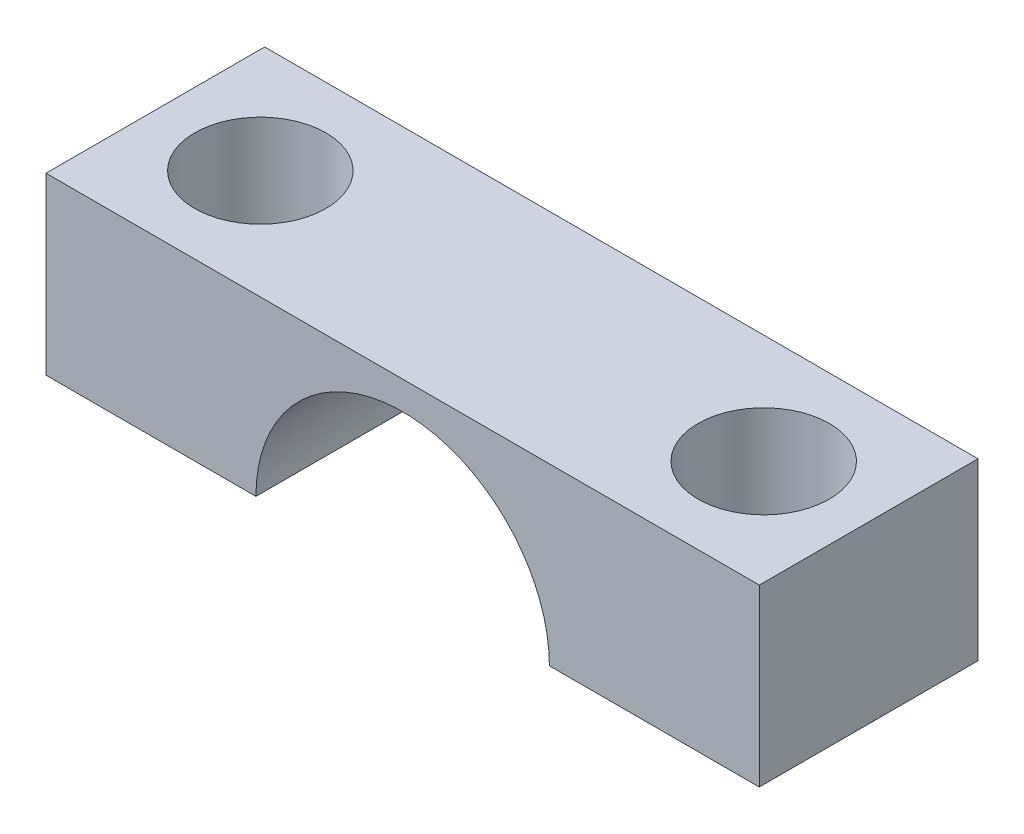
ISO-10303-21;
HEADER;
FILE_DESCRIPTION(('STEP AP214'),'2;1');
FILE_NAME('part.step','',(''),(''),'','','');
FILE_SCHEMA(('AUTOMOTIVE_DESIGN { 1 0 10303 214 1 1 1 1 }'));
ENDSEC;
DATA;
#1=APPLICATION_CONTEXT('core data for automotive mechanical design processes');
#2=APPLICATION_PROTOCOL_DEFINITION('international standard','automotive_design',2000,#1);
#3=PRODUCT_CONTEXT('',#1,'mechanical');
#4=PRODUCT('Part','Part','',(#3));
#5=PRODUCT_RELATED_PRODUCT_CATEGORY('part','',(#4));
#6=PRODUCT_DEFINITION_FORMATION('','',#4);
#7=PRODUCT_DEFINITION_CONTEXT('part definition',#1,'design');
#8=PRODUCT_DEFINITION('design','',#6,#7);
#9=PRODUCT_DEFINITION_SHAPE('','',#8);
#10=(LENGTH_UNIT() NAMED_UNIT(*) SI_UNIT(.MILLI.,.METRE.));
#11=(NAMED_UNIT(*) PLANE_ANGLE_UNIT() SI_UNIT($,.RADIAN.));
#12=(NAMED_UNIT(*) SI_UNIT($,.STERADIAN.) SOLID_ANGLE_UNIT());
#13=UNCERTAINTY_MEASURE_WITH_UNIT(LENGTH_MEASURE(1.E-05),#10,'distance_accuracy_value','');
#14=(GEOMETRIC_REPRESENTATION_CONTEXT(3) GLOBAL_UNCERTAINTY_ASSIGNED_CONTEXT((#13)) GLOBAL_UNIT_ASSIGNED_CONTEXT((#10,
#11,#12)) REPRESENTATION_CONTEXT('',''));
#15=CARTESIAN_POINT('',(0.,0.,0.));
#16=DIRECTION('',(0.,0.,1.));
#17=DIRECTION('',(1.,0.,0.));
#18=AXIS2_PLACEMENT_3D('',#15,#16,#17);
#19=CARTESIAN_POINT('',(-8.155,-2.,-5.));
#20=DIRECTION('',(0.,-1.,0.));
#21=DIRECTION('',(0.,0.,-1.));
#22=AXIS2_PLACEMENT_3D('',#19,#20,#21);
#23=PLANE('',#22);
#24=CARTESIAN_POINT('',(5.755,-2.,-2.5));
#25=DIRECTION('',(0.,-1.,0.));
#26=DIRECTION('',(0.,0.,-1.));
#27=AXIS2_PLACEMENT_3D('',#24,#25,#26);
#28=CIRCLE('',#27,1.5);
#29=CARTESIAN_POINT('',(5.755,-2.,-4.));
#30=VERTEX_POINT('',#29);
#31=EDGE_CURVE('E157',#30,#30,#28,.F.);
#32=ORIENTED_EDGE('',*,*,#31,.T.);
#33=EDGE_LOOP('',(#32));
#34=FACE_BOUND('',#33,.T.);
#35=DIRECTION('',(0.,0.,1.));
#36=VECTOR('',#35,1.);
#37=CARTESIAN_POINT('',(3.355,-2.,-5.));
#38=LINE('',#37,#36);
#39=CARTESIAN_POINT('',(3.355,-2.,-5.));
#40=VERTEX_POINT('',#39);
#41=CARTESIAN_POINT('',(3.355,-2.,0.));
#42=VERTEX_POINT('',#41);
#43=EDGE_CURVE('E59',#40,#42,#38,.T.);
#44=ORIENTED_EDGE('',*,*,#43,.F.);
#45=DIRECTION('',(1.,0.,0.));
#46=VECTOR('',#45,1.);
#47=CARTESIAN_POINT('',(-8.155,-2.,-5.));
#48=LINE('',#47,#46);
#49=CARTESIAN_POINT('',(8.155,-2.,-5.));
#50=VERTEX_POINT('',#49);
#51=EDGE_CURVE('E91',#40,#50,#48,.T.);
#52=ORIENTED_EDGE('',*,*,#51,.T.);
#53=DIRECTION('',(0.,0.,1.));
#54=VECTOR('',#53,1.);
#55=CARTESIAN_POINT('',(8.155,-2.,-5.));
#56=LINE('',#55,#54);
#57=CARTESIAN_POINT('',(8.155,-2.,0.));
#58=VERTEX_POINT('',#57);
#59=EDGE_CURVE('E132',#50,#58,#56,.T.);
#60=ORIENTED_EDGE('',*,*,#59,.T.);
#61=DIRECTION('',(1.,0.,0.));
#62=VECTOR('',#61,1.);
#63=CARTESIAN_POINT('',(-8.155,-2.,0.));
#64=LINE('',#63,#62);
#65=EDGE_CURVE('E137',#42,#58,#64,.T.);
#66=ORIENTED_EDGE('',*,*,#65,.F.);
#67=EDGE_LOOP('',(#44,#52,#60,#66));
#68=FACE_BOUND('',#67,.T.);
#69=ADVANCED_FACE('F41',(#34,#68),#23,.T.);
#70=CARTESIAN_POINT('',(-5.755,-2.,-2.5));
#71=DIRECTION('',(0.,-1.,0.));
#72=DIRECTION('',(0.,0.,-1.));
#73=AXIS2_PLACEMENT_3D('',#70,#71,#72);
#74=CIRCLE('',#73,1.5);
#75=CARTESIAN_POINT('',(-5.755,-2.,-4.));
#76=VERTEX_POINT('',#75);
#77=EDGE_CURVE('E167',#76,#76,#74,.F.);
#78=ORIENTED_EDGE('',*,*,#77,.T.);
#79=EDGE_LOOP('',(#78));
#80=FACE_BOUND('',#79,.T.);
#81=DIRECTION('',(0.,0.,1.));
#82=VECTOR('',#81,1.);
#83=CARTESIAN_POINT('',(-3.355,-2.,-5.));
#84=LINE('',#83,#82);
#85=CARTESIAN_POINT('',(-3.355,-2.,-5.));
#86=VERTEX_POINT('',#85);
#87=CARTESIAN_POINT('',(-3.355,-2.,0.));
#88=VERTEX_POINT('',#87);
#89=EDGE_CURVE('E101',#86,#88,#84,.T.);
#90=ORIENTED_EDGE('',*,*,#89,.T.);
#91=CARTESIAN_POINT('',(-8.155,-2.,0.));
#92=VERTEX_POINT('',#91);
#93=EDGE_CURVE('E133',#92,#88,#64,.T.);
#94=ORIENTED_EDGE('',*,*,#93,.F.);
#95=DIRECTION('',(0.,0.,1.));
#96=VECTOR('',#95,1.);
#97=CARTESIAN_POINT('',(-8.155,-2.,-5.));
#98=LINE('',#97,#96);
#99=CARTESIAN_POINT('',(-8.155,-2.,-5.));
#100=VERTEX_POINT('',#99);
#101=EDGE_CURVE('E11',#100,#92,#98,.T.);
#102=ORIENTED_EDGE('',*,*,#101,.F.);
#103=EDGE_CURVE('E112',#100,#86,#48,.T.);
#104=ORIENTED_EDGE('',*,*,#103,.T.);
#105=EDGE_LOOP('',(#90,#94,#102,#104));
#106=FACE_BOUND('',#105,.T.);
#107=ADVANCED_FACE('F43',(#80,#106),#23,.T.);
#108=CARTESIAN_POINT('',(-8.155,-2.,-5.));
#109=DIRECTION('',(1.,0.,0.));
#110=DIRECTION('',(0.,0.,-1.));
#111=AXIS2_PLACEMENT_3D('',#108,#109,#110);
#112=PLANE('',#111);
#113=DIRECTION('',(0.,1.,0.));
#114=VECTOR('',#113,1.);
#115=CARTESIAN_POINT('',(-8.155,-2.,0.));
#116=LINE('',#115,#114);
#117=CARTESIAN_POINT('',(-8.155,2.,0.));
#118=VERTEX_POINT('',#117);
#119=EDGE_CURVE('E124',#92,#118,#116,.T.);
#120=ORIENTED_EDGE('',*,*,#119,.T.);
#121=DIRECTION('',(0.,0.,1.));
#122=VECTOR('',#121,1.);
#123=CARTESIAN_POINT('',(-8.155,2.,-5.));
#124=LINE('',#123,#122);
#125=CARTESIAN_POINT('',(-8.155,2.,-5.));
#126=VERTEX_POINT('',#125);
#127=EDGE_CURVE('E51',#126,#118,#124,.T.);
#128=ORIENTED_EDGE('',*,*,#127,.F.);
#129=DIRECTION('',(0.,1.,0.));
#130=VECTOR('',#129,1.);
#131=CARTESIAN_POINT('',(-8.155,-2.,-5.));
#132=LINE('',#131,#130);
#133=EDGE_CURVE('E129',#100,#126,#132,.T.);
#134=ORIENTED_EDGE('',*,*,#133,.F.);
#135=ORIENTED_EDGE('',*,*,#101,.T.);
#136=EDGE_LOOP('',(#120,#128,#134,#135));
#137=FACE_BOUND('',#136,.T.);
#138=ADVANCED_FACE('F187',(#137),#112,.F.);
#139=CARTESIAN_POINT('',(-8.155,2.,-5.));
#140=DIRECTION('',(0.,-1.,0.));
#141=DIRECTION('',(0.,0.,-1.));
#142=AXIS2_PLACEMENT_3D('',#139,#140,#141);
#143=PLANE('',#142);
#144=CARTESIAN_POINT('',(-5.755,2.,-2.5));
#145=DIRECTION('',(0.,-1.,0.));
#146=DIRECTION('',(0.,0.,-1.));
#147=AXIS2_PLACEMENT_3D('',#144,#145,#146);
#148=CIRCLE('',#147,1.5);
#149=CARTESIAN_POINT('',(-5.755,2.,-4.));
#150=VERTEX_POINT('',#149);
#151=EDGE_CURVE('E45',#150,#150,#148,.F.);
#152=ORIENTED_EDGE('',*,*,#151,.F.);
#153=EDGE_LOOP('',(#152));
#154=FACE_BOUND('',#153,.T.);
#155=CARTESIAN_POINT('',(5.755,2.,-2.5));
#156=DIRECTION('',(0.,-1.,0.));
#157=DIRECTION('',(0.,0.,-1.));
#158=AXIS2_PLACEMENT_3D('',#155,#156,#157);
#159=CIRCLE('',#158,1.5);
#160=CARTESIAN_POINT('',(5.755,2.,-4.));
#161=VERTEX_POINT('',#160);
#162=EDGE_CURVE('E154',#161,#161,#159,.F.);
#163=ORIENTED_EDGE('',*,*,#162,.F.);
#164=EDGE_LOOP('',(#163));
#165=FACE_BOUND('',#164,.T.);
#166=DIRECTION('',(1.,0.,0.));
#167=VECTOR('',#166,1.);
#168=CARTESIAN_POINT('',(-8.155,2.,0.));
#169=LINE('',#168,#167);
#170=CARTESIAN_POINT('',(8.155,2.,0.));
#171=VERTEX_POINT('',#170);
#172=EDGE_CURVE('E141',#118,#171,#169,.T.);
#173=ORIENTED_EDGE('',*,*,#172,.T.);
#174=DIRECTION('',(0.,0.,1.));
#175=VECTOR('',#174,1.);
#176=CARTESIAN_POINT('',(8.155,2.,-5.));
#177=LINE('',#176,#175);
#178=CARTESIAN_POINT('',(8.155,2.,-5.));
#179=VERTEX_POINT('',#178);
#180=EDGE_CURVE('E150',#179,#171,#177,.T.);
#181=ORIENTED_EDGE('',*,*,#180,.F.);
#182=DIRECTION('',(1.,0.,0.));
#183=VECTOR('',#182,1.);
#184=CARTESIAN_POINT('',(-8.155,2.,-5.));
#185=LINE('',#184,#183);
#186=EDGE_CURVE('E122',#126,#179,#185,.T.);
#187=ORIENTED_EDGE('',*,*,#186,.F.);
#188=ORIENTED_EDGE('',*,*,#127,.T.);
#189=EDGE_LOOP('',(#173,#181,#187,#188));
#190=FACE_BOUND('',#189,.T.);
#191=ADVANCED_FACE('F185',(#154,#165,#190),#143,.F.);
#192=CARTESIAN_POINT('',(8.155,-2.,-5.));
#193=DIRECTION('',(1.,0.,0.));
#194=DIRECTION('',(0.,0.,-1.));
#195=AXIS2_PLACEMENT_3D('',#192,#193,#194);
#196=PLANE('',#195);
#197=DIRECTION('',(0.,1.,0.));
#198=VECTOR('',#197,1.);
#199=CARTESIAN_POINT('',(8.155,-2.,0.));
#200=LINE('',#199,#198);
#201=EDGE_CURVE('E136',#58,#171,#200,.T.);
#202=ORIENTED_EDGE('',*,*,#201,.F.);
#203=ORIENTED_EDGE('',*,*,#59,.F.);
#204=DIRECTION('',(0.,1.,0.));
#205=VECTOR('',#204,1.);
#206=CARTESIAN_POINT('',(8.155,-2.,-5.));
#207=LINE('',#206,#205);
#208=EDGE_CURVE('E117',#50,#179,#207,.T.);
#209=ORIENTED_EDGE('',*,*,#208,.T.);
#210=ORIENTED_EDGE('',*,*,#180,.T.);
#211=EDGE_LOOP('',(#202,#203,#209,#210));
#212=FACE_BOUND('',#211,.T.);
#213=ADVANCED_FACE('F181',(#212),#196,.T.);
#214=CARTESIAN_POINT('',(0.,0.,-5.));
#215=DIRECTION('',(0.,0.,1.));
#216=DIRECTION('',(1.,0.,0.));
#217=AXIS2_PLACEMENT_3D('',#214,#215,#216);
#218=PLANE('',#217);
#219=ORIENTED_EDGE('',*,*,#51,.F.);
#220=CARTESIAN_POINT('',(0.,-2.,-5.));
#221=DIRECTION('',(0.,0.,1.));
#222=DIRECTION('',(1.,0.,0.));
#223=AXIS2_PLACEMENT_3D('',#220,#221,#222);
#224=CIRCLE('',#223,3.355);
#225=EDGE_CURVE('E104',#40,#86,#224,.T.);
#226=ORIENTED_EDGE('',*,*,#225,.T.);
#227=ORIENTED_EDGE('',*,*,#103,.F.);
#228=ORIENTED_EDGE('',*,*,#133,.T.);
#229=ORIENTED_EDGE('',*,*,#186,.T.);
#230=ORIENTED_EDGE('',*,*,#208,.F.);
#231=EDGE_LOOP('',(#219,#226,#227,#228,#229,#230));
#232=FACE_BOUND('',#231,.T.);
#233=ADVANCED_FACE('F111',(#232),#218,.F.);
#234=CARTESIAN_POINT('',(0.,0.,0.));
#235=DIRECTION('',(0.,0.,1.));
#236=DIRECTION('',(1.,0.,0.));
#237=AXIS2_PLACEMENT_3D('',#234,#235,#236);
#238=PLANE('',#237);
#239=CARTESIAN_POINT('',(0.,-2.,0.));
#240=DIRECTION('',(0.,0.,1.));
#241=DIRECTION('',(1.,0.,0.));
#242=AXIS2_PLACEMENT_3D('',#239,#240,#241);
#243=CIRCLE('',#242,3.355);
#244=EDGE_CURVE('E105',#42,#88,#243,.T.);
#245=ORIENTED_EDGE('',*,*,#244,.F.);
#246=ORIENTED_EDGE('',*,*,#65,.T.);
#247=ORIENTED_EDGE('',*,*,#201,.T.);
#248=ORIENTED_EDGE('',*,*,#172,.F.);
#249=ORIENTED_EDGE('',*,*,#119,.F.);
#250=ORIENTED_EDGE('',*,*,#93,.T.);
#251=EDGE_LOOP('',(#245,#246,#247,#248,#249,#250));
#252=FACE_BOUND('',#251,.T.);
#253=ADVANCED_FACE('F177',(#252),#238,.T.);
#254=CARTESIAN_POINT('',(0.,-2.,-5.));
#255=DIRECTION('',(0.,0.,1.));
#256=DIRECTION('',(1.,0.,0.));
#257=AXIS2_PLACEMENT_3D('',#254,#255,#256);
#258=CYLINDRICAL_SURFACE('',#257,3.355);
#259=ORIENTED_EDGE('',*,*,#244,.T.);
#260=ORIENTED_EDGE('',*,*,#89,.F.);
#261=ORIENTED_EDGE('',*,*,#225,.F.);
#262=ORIENTED_EDGE('',*,*,#43,.T.);
#263=EDGE_LOOP('',(#259,#260,#261,#262));
#264=FACE_BOUND('',#263,.T.);
#265=ADVANCED_FACE('F103',(#264),#258,.F.);
#266=CARTESIAN_POINT('',(5.755,2.5,-2.5));
#267=DIRECTION('',(0.,-1.,0.));
#268=DIRECTION('',(0.,0.,-1.));
#269=AXIS2_PLACEMENT_3D('',#266,#267,#268);
#270=CYLINDRICAL_SURFACE('',#269,1.5);
#271=ORIENTED_EDGE('',*,*,#31,.F.);
#272=EDGE_LOOP('',(#271));
#273=FACE_BOUND('',#272,.T.);
#274=ORIENTED_EDGE('',*,*,#162,.T.);
#275=EDGE_LOOP('',(#274));
#276=FACE_BOUND('',#275,.T.);
#277=ADVANCED_FACE('F220',(#273,#276),#270,.F.);
#278=CARTESIAN_POINT('',(-5.755,2.5,-2.5));
#279=DIRECTION('',(0.,-1.,0.));
#280=DIRECTION('',(0.,0.,-1.));
#281=AXIS2_PLACEMENT_3D('',#278,#279,#280);
#282=CYLINDRICAL_SURFACE('',#281,1.5);
#283=ORIENTED_EDGE('',*,*,#77,.F.);
#284=EDGE_LOOP('',(#283));
#285=FACE_BOUND('',#284,.T.);
#286=ORIENTED_EDGE('',*,*,#151,.T.);
#287=EDGE_LOOP('',(#286));
#288=FACE_BOUND('',#287,.T.);
#289=ADVANCED_FACE('F225',(#285,#288),#282,.F.);
#290=CLOSED_SHELL('',(#69,#107,#138,#191,#213,#233,#253,#265,#277,#289));
#291=MANIFOLD_SOLID_BREP('B2',#290);
#292=ADVANCED_BREP_SHAPE_REPRESENTATION('',(#18,#291),#14);
#293=SHAPE_DEFINITION_REPRESENTATION(#9,#292);
ENDSEC;
END-ISO-10303-21;
